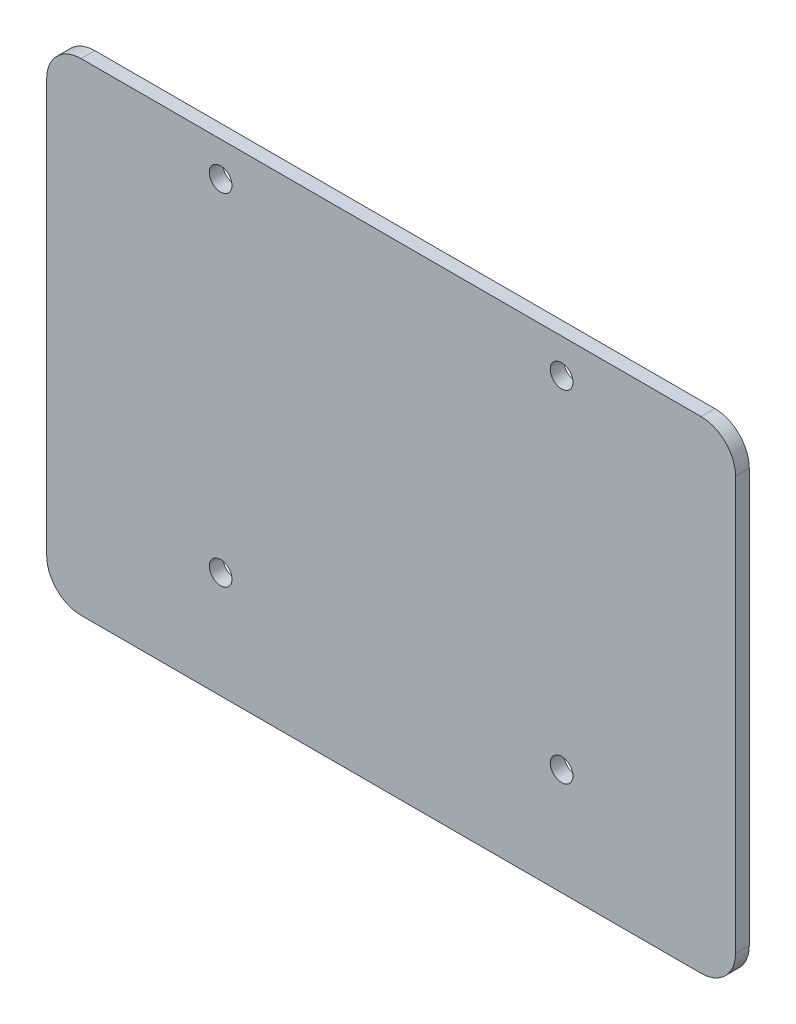
ISO-10303-21;
HEADER;
FILE_DESCRIPTION(('STEP AP214'),'2;1');
FILE_NAME('part.step','',(''),(''),'','','');
FILE_SCHEMA(('AUTOMOTIVE_DESIGN { 1 0 10303 214 1 1 1 1 }'));
ENDSEC;
DATA;
#1=APPLICATION_CONTEXT('core data for automotive mechanical design processes');
#2=APPLICATION_PROTOCOL_DEFINITION('international standard','automotive_design',2000,#1);
#3=PRODUCT_CONTEXT('',#1,'mechanical');
#4=PRODUCT('Part','Part','',(#3));
#5=PRODUCT_RELATED_PRODUCT_CATEGORY('part','',(#4));
#6=PRODUCT_DEFINITION_FORMATION('','',#4);
#7=PRODUCT_DEFINITION_CONTEXT('part definition',#1,'design');
#8=PRODUCT_DEFINITION('design','',#6,#7);
#9=PRODUCT_DEFINITION_SHAPE('','',#8);
#10=(LENGTH_UNIT() NAMED_UNIT(*) SI_UNIT(.MILLI.,.METRE.));
#11=(NAMED_UNIT(*) PLANE_ANGLE_UNIT() SI_UNIT($,.RADIAN.));
#12=(NAMED_UNIT(*) SI_UNIT($,.STERADIAN.) SOLID_ANGLE_UNIT());
#13=UNCERTAINTY_MEASURE_WITH_UNIT(LENGTH_MEASURE(1.E-05),#10,'distance_accuracy_value','');
#14=(GEOMETRIC_REPRESENTATION_CONTEXT(3) GLOBAL_UNCERTAINTY_ASSIGNED_CONTEXT((#13)) GLOBAL_UNIT_ASSIGNED_CONTEXT((#10,
#11,#12)) REPRESENTATION_CONTEXT('',''));
#15=CARTESIAN_POINT('',(0.,0.,0.));
#16=DIRECTION('',(0.,0.,1.));
#17=DIRECTION('',(1.,0.,0.));
#18=AXIS2_PLACEMENT_3D('',#15,#16,#17);
#19=CARTESIAN_POINT('',(0.,0.,2.));
#20=DIRECTION('',(0.,0.,-1.));
#21=DIRECTION('',(-1.,0.,0.));
#22=AXIS2_PLACEMENT_3D('',#19,#20,#21);
#23=PLANE('',#22);
#24=DIRECTION('',(-1.,0.,0.));
#25=VECTOR('',#24,1.);
#26=CARTESIAN_POINT('',(0.,70.,2.));
#27=LINE('',#26,#25);
#28=CARTESIAN_POINT('',(95.,70.,2.));
#29=VERTEX_POINT('',#28);
#30=CARTESIAN_POINT('',(5.,70.,2.));
#31=VERTEX_POINT('',#30);
#32=EDGE_CURVE('E136',#29,#31,#27,.T.);
#33=ORIENTED_EDGE('',*,*,#32,.T.);
#34=CARTESIAN_POINT('',(5.,65.,2.));
#35=DIRECTION('',(0.,0.,-1.));
#36=DIRECTION('',(-1.,0.,0.));
#37=AXIS2_PLACEMENT_3D('',#34,#35,#36);
#38=CIRCLE('',#37,5.);
#39=CARTESIAN_POINT('',(0.,65.,2.));
#40=VERTEX_POINT('',#39);
#41=EDGE_CURVE('E155',#31,#40,#38,.F.);
#42=ORIENTED_EDGE('',*,*,#41,.T.);
#43=DIRECTION('',(0.,-1.,0.));
#44=VECTOR('',#43,1.);
#45=CARTESIAN_POINT('',(0.,0.,2.));
#46=LINE('',#45,#44);
#47=CARTESIAN_POINT('',(0.,5.,2.));
#48=VERTEX_POINT('',#47);
#49=EDGE_CURVE('E119',#40,#48,#46,.T.);
#50=ORIENTED_EDGE('',*,*,#49,.T.);
#51=CARTESIAN_POINT('',(5.,5.,2.));
#52=DIRECTION('',(0.,0.,-1.));
#53=DIRECTION('',(-1.,0.,0.));
#54=AXIS2_PLACEMENT_3D('',#51,#52,#53);
#55=CIRCLE('',#54,5.);
#56=CARTESIAN_POINT('',(5.,0.,2.));
#57=VERTEX_POINT('',#56);
#58=EDGE_CURVE('E150',#48,#57,#55,.F.);
#59=ORIENTED_EDGE('',*,*,#58,.T.);
#60=DIRECTION('',(1.,0.,0.));
#61=VECTOR('',#60,1.);
#62=CARTESIAN_POINT('',(0.,0.,2.));
#63=LINE('',#62,#61);
#64=CARTESIAN_POINT('',(95.,0.,2.));
#65=VERTEX_POINT('',#64);
#66=EDGE_CURVE('E166',#57,#65,#63,.T.);
#67=ORIENTED_EDGE('',*,*,#66,.T.);
#68=CARTESIAN_POINT('',(95.,5.,2.));
#69=DIRECTION('',(0.,0.,-1.));
#70=DIRECTION('',(-1.,0.,0.));
#71=AXIS2_PLACEMENT_3D('',#68,#69,#70);
#72=CIRCLE('',#71,5.);
#73=CARTESIAN_POINT('',(100.,5.,2.));
#74=VERTEX_POINT('',#73);
#75=EDGE_CURVE('E55',#65,#74,#72,.F.);
#76=ORIENTED_EDGE('',*,*,#75,.T.);
#77=DIRECTION('',(0.,1.,0.));
#78=VECTOR('',#77,1.);
#79=CARTESIAN_POINT('',(100.,0.,2.));
#80=LINE('',#79,#78);
#81=CARTESIAN_POINT('',(100.,65.,2.));
#82=VERTEX_POINT('',#81);
#83=EDGE_CURVE('E174',#74,#82,#80,.T.);
#84=ORIENTED_EDGE('',*,*,#83,.T.);
#85=CARTESIAN_POINT('',(95.,65.,2.));
#86=DIRECTION('',(0.,0.,-1.));
#87=DIRECTION('',(-1.,0.,0.));
#88=AXIS2_PLACEMENT_3D('',#85,#86,#87);
#89=CIRCLE('',#88,5.);
#90=EDGE_CURVE('E153',#82,#29,#89,.F.);
#91=ORIENTED_EDGE('',*,*,#90,.T.);
#92=EDGE_LOOP('',(#33,#42,#50,#59,#67,#76,#84,#91));
#93=FACE_BOUND('',#92,.T.);
#94=CARTESIAN_POINT('',(25.25,65.,2.));
#95=DIRECTION('',(0.,0.,1.));
#96=DIRECTION('',(1.,0.,0.));
#97=AXIS2_PLACEMENT_3D('',#94,#95,#96);
#98=CIRCLE('',#97,1.65);
#99=CARTESIAN_POINT('',(26.9,65.,2.));
#100=VERTEX_POINT('',#99);
#101=EDGE_CURVE('E127',#100,#100,#98,.T.);
#102=ORIENTED_EDGE('',*,*,#101,.F.);
#103=EDGE_LOOP('',(#102));
#104=FACE_BOUND('',#103,.T.);
#105=CARTESIAN_POINT('',(25.25,15.5,2.));
#106=DIRECTION('',(0.,0.,1.));
#107=DIRECTION('',(1.,0.,0.));
#108=AXIS2_PLACEMENT_3D('',#105,#106,#107);
#109=CIRCLE('',#108,1.65);
#110=CARTESIAN_POINT('',(26.9,15.5,2.));
#111=VERTEX_POINT('',#110);
#112=EDGE_CURVE('E181',#111,#111,#109,.T.);
#113=ORIENTED_EDGE('',*,*,#112,.F.);
#114=EDGE_LOOP('',(#113));
#115=FACE_BOUND('',#114,.T.);
#116=CARTESIAN_POINT('',(74.75,15.5,2.));
#117=DIRECTION('',(0.,0.,1.));
#118=DIRECTION('',(-1.,0.,0.));
#119=AXIS2_PLACEMENT_3D('',#116,#117,#118);
#120=CIRCLE('',#119,1.65);
#121=CARTESIAN_POINT('',(73.1,15.5,2.));
#122=VERTEX_POINT('',#121);
#123=EDGE_CURVE('E186',#122,#122,#120,.T.);
#124=ORIENTED_EDGE('',*,*,#123,.F.);
#125=EDGE_LOOP('',(#124));
#126=FACE_BOUND('',#125,.T.);
#127=CARTESIAN_POINT('',(74.75,65.,2.));
#128=DIRECTION('',(0.,0.,1.));
#129=DIRECTION('',(-1.,0.,0.));
#130=AXIS2_PLACEMENT_3D('',#127,#128,#129);
#131=CIRCLE('',#130,1.65);
#132=CARTESIAN_POINT('',(73.1,65.,2.));
#133=VERTEX_POINT('',#132);
#134=EDGE_CURVE('E192',#133,#133,#131,.T.);
#135=ORIENTED_EDGE('',*,*,#134,.F.);
#136=EDGE_LOOP('',(#135));
#137=FACE_BOUND('',#136,.T.);
#138=ADVANCED_FACE('F33',(#93,#104,#115,#126,#137),#23,.F.);
#139=CARTESIAN_POINT('',(0.,0.,0.));
#140=DIRECTION('',(0.,0.,-1.));
#141=DIRECTION('',(-1.,0.,0.));
#142=AXIS2_PLACEMENT_3D('',#139,#140,#141);
#143=PLANE('',#142);
#144=CARTESIAN_POINT('',(74.75,15.5,0.));
#145=DIRECTION('',(0.,0.,1.));
#146=DIRECTION('',(-1.,0.,0.));
#147=AXIS2_PLACEMENT_3D('',#144,#145,#146);
#148=CIRCLE('',#147,1.65);
#149=CARTESIAN_POINT('',(73.1,15.5,0.));
#150=VERTEX_POINT('',#149);
#151=EDGE_CURVE('E189',#150,#150,#148,.T.);
#152=ORIENTED_EDGE('',*,*,#151,.T.);
#153=EDGE_LOOP('',(#152));
#154=FACE_BOUND('',#153,.T.);
#155=CARTESIAN_POINT('',(25.25,65.,0.));
#156=DIRECTION('',(0.,0.,1.));
#157=DIRECTION('',(1.,0.,0.));
#158=AXIS2_PLACEMENT_3D('',#155,#156,#157);
#159=CIRCLE('',#158,1.65);
#160=CARTESIAN_POINT('',(26.9,65.,0.));
#161=VERTEX_POINT('',#160);
#162=EDGE_CURVE('E133',#161,#161,#159,.T.);
#163=ORIENTED_EDGE('',*,*,#162,.T.);
#164=EDGE_LOOP('',(#163));
#165=FACE_BOUND('',#164,.T.);
#166=DIRECTION('',(0.,-1.,0.));
#167=VECTOR('',#166,1.);
#168=CARTESIAN_POINT('',(0.,0.,0.));
#169=LINE('',#168,#167);
#170=CARTESIAN_POINT('',(0.,65.,0.));
#171=VERTEX_POINT('',#170);
#172=CARTESIAN_POINT('',(0.,5.,0.));
#173=VERTEX_POINT('',#172);
#174=EDGE_CURVE('E116',#171,#173,#169,.T.);
#175=ORIENTED_EDGE('',*,*,#174,.F.);
#176=CARTESIAN_POINT('',(5.,65.,0.));
#177=DIRECTION('',(0.,0.,-1.));
#178=DIRECTION('',(-1.,0.,0.));
#179=AXIS2_PLACEMENT_3D('',#176,#177,#178);
#180=CIRCLE('',#179,5.);
#181=CARTESIAN_POINT('',(5.,70.,0.));
#182=VERTEX_POINT('',#181);
#183=EDGE_CURVE('E99',#171,#182,#180,.T.);
#184=ORIENTED_EDGE('',*,*,#183,.T.);
#185=DIRECTION('',(-1.,0.,0.));
#186=VECTOR('',#185,1.);
#187=CARTESIAN_POINT('',(0.,70.,0.));
#188=LINE('',#187,#186);
#189=CARTESIAN_POINT('',(95.,70.,0.));
#190=VERTEX_POINT('',#189);
#191=EDGE_CURVE('E140',#190,#182,#188,.T.);
#192=ORIENTED_EDGE('',*,*,#191,.F.);
#193=CARTESIAN_POINT('',(95.,65.,0.));
#194=DIRECTION('',(0.,0.,-1.));
#195=DIRECTION('',(-1.,0.,0.));
#196=AXIS2_PLACEMENT_3D('',#193,#194,#195);
#197=CIRCLE('',#196,5.);
#198=CARTESIAN_POINT('',(100.,65.,0.));
#199=VERTEX_POINT('',#198);
#200=EDGE_CURVE('E110',#190,#199,#197,.T.);
#201=ORIENTED_EDGE('',*,*,#200,.T.);
#202=DIRECTION('',(0.,1.,0.));
#203=VECTOR('',#202,1.);
#204=CARTESIAN_POINT('',(100.,0.,0.));
#205=LINE('',#204,#203);
#206=CARTESIAN_POINT('',(100.,5.,0.));
#207=VERTEX_POINT('',#206);
#208=EDGE_CURVE('E130',#207,#199,#205,.T.);
#209=ORIENTED_EDGE('',*,*,#208,.F.);
#210=CARTESIAN_POINT('',(95.,5.,0.));
#211=DIRECTION('',(0.,0.,-1.));
#212=DIRECTION('',(-1.,0.,0.));
#213=AXIS2_PLACEMENT_3D('',#210,#211,#212);
#214=CIRCLE('',#213,5.);
#215=CARTESIAN_POINT('',(95.,0.,0.));
#216=VERTEX_POINT('',#215);
#217=EDGE_CURVE('E144',#207,#216,#214,.T.);
#218=ORIENTED_EDGE('',*,*,#217,.T.);
#219=DIRECTION('',(1.,0.,0.));
#220=VECTOR('',#219,1.);
#221=CARTESIAN_POINT('',(0.,0.,0.));
#222=LINE('',#221,#220);
#223=CARTESIAN_POINT('',(5.,0.,0.));
#224=VERTEX_POINT('',#223);
#225=EDGE_CURVE('E126',#224,#216,#222,.T.);
#226=ORIENTED_EDGE('',*,*,#225,.F.);
#227=CARTESIAN_POINT('',(5.,5.,0.));
#228=DIRECTION('',(0.,0.,-1.));
#229=DIRECTION('',(-1.,0.,0.));
#230=AXIS2_PLACEMENT_3D('',#227,#228,#229);
#231=CIRCLE('',#230,5.);
#232=EDGE_CURVE('E120',#224,#173,#231,.T.);
#233=ORIENTED_EDGE('',*,*,#232,.T.);
#234=EDGE_LOOP('',(#175,#184,#192,#201,#209,#218,#226,#233));
#235=FACE_BOUND('',#234,.T.);
#236=CARTESIAN_POINT('',(25.25,15.5,0.));
#237=DIRECTION('',(0.,0.,1.));
#238=DIRECTION('',(1.,0.,0.));
#239=AXIS2_PLACEMENT_3D('',#236,#237,#238);
#240=CIRCLE('',#239,1.65);
#241=CARTESIAN_POINT('',(26.9,15.5,0.));
#242=VERTEX_POINT('',#241);
#243=EDGE_CURVE('E183',#242,#242,#240,.T.);
#244=ORIENTED_EDGE('',*,*,#243,.T.);
#245=EDGE_LOOP('',(#244));
#246=FACE_BOUND('',#245,.T.);
#247=CARTESIAN_POINT('',(74.75,65.,0.));
#248=DIRECTION('',(0.,0.,1.));
#249=DIRECTION('',(-1.,0.,0.));
#250=AXIS2_PLACEMENT_3D('',#247,#248,#249);
#251=CIRCLE('',#250,1.65);
#252=CARTESIAN_POINT('',(73.1,65.,0.));
#253=VERTEX_POINT('',#252);
#254=EDGE_CURVE('E195',#253,#253,#251,.T.);
#255=ORIENTED_EDGE('',*,*,#254,.T.);
#256=EDGE_LOOP('',(#255));
#257=FACE_BOUND('',#256,.T.);
#258=ADVANCED_FACE('F123',(#154,#165,#235,#246,#257),#143,.T.);
#259=CARTESIAN_POINT('',(0.,0.,2.));
#260=DIRECTION('',(1.,0.,0.));
#261=DIRECTION('',(0.,0.,-1.));
#262=AXIS2_PLACEMENT_3D('',#259,#260,#261);
#263=PLANE('',#262);
#264=ORIENTED_EDGE('',*,*,#49,.F.);
#265=DIRECTION('',(0.,0.,-1.));
#266=VECTOR('',#265,1.);
#267=CARTESIAN_POINT('',(0.,65.,2.));
#268=LINE('',#267,#266);
#269=EDGE_CURVE('E103',#40,#171,#268,.T.);
#270=ORIENTED_EDGE('',*,*,#269,.T.);
#271=ORIENTED_EDGE('',*,*,#174,.T.);
#272=DIRECTION('',(0.,0.,-1.));
#273=VECTOR('',#272,1.);
#274=CARTESIAN_POINT('',(0.,5.,2.));
#275=LINE('',#274,#273);
#276=EDGE_CURVE('E121',#173,#48,#275,.F.);
#277=ORIENTED_EDGE('',*,*,#276,.T.);
#278=EDGE_LOOP('',(#264,#270,#271,#277));
#279=FACE_BOUND('',#278,.T.);
#280=ADVANCED_FACE('F115',(#279),#263,.F.);
#281=CARTESIAN_POINT('',(0.,0.,2.));
#282=DIRECTION('',(0.,1.,0.));
#283=DIRECTION('',(0.,0.,1.));
#284=AXIS2_PLACEMENT_3D('',#281,#282,#283);
#285=PLANE('',#284);
#286=ORIENTED_EDGE('',*,*,#225,.T.);
#287=DIRECTION('',(0.,0.,-1.));
#288=VECTOR('',#287,1.);
#289=CARTESIAN_POINT('',(95.,0.,2.));
#290=LINE('',#289,#288);
#291=EDGE_CURVE('E11',#216,#65,#290,.F.);
#292=ORIENTED_EDGE('',*,*,#291,.T.);
#293=ORIENTED_EDGE('',*,*,#66,.F.);
#294=DIRECTION('',(0.,0.,-1.));
#295=VECTOR('',#294,1.);
#296=CARTESIAN_POINT('',(5.,0.,2.));
#297=LINE('',#296,#295);
#298=EDGE_CURVE('E41',#57,#224,#297,.T.);
#299=ORIENTED_EDGE('',*,*,#298,.T.);
#300=EDGE_LOOP('',(#286,#292,#293,#299));
#301=FACE_BOUND('',#300,.T.);
#302=ADVANCED_FACE('F164',(#301),#285,.F.);
#303=CARTESIAN_POINT('',(100.,0.,2.));
#304=DIRECTION('',(-1.,0.,0.));
#305=DIRECTION('',(0.,0.,1.));
#306=AXIS2_PLACEMENT_3D('',#303,#304,#305);
#307=PLANE('',#306);
#308=ORIENTED_EDGE('',*,*,#208,.T.);
#309=DIRECTION('',(0.,0.,-1.));
#310=VECTOR('',#309,1.);
#311=CARTESIAN_POINT('',(100.,65.,2.));
#312=LINE('',#311,#310);
#313=EDGE_CURVE('E48',#199,#82,#312,.F.);
#314=ORIENTED_EDGE('',*,*,#313,.T.);
#315=ORIENTED_EDGE('',*,*,#83,.F.);
#316=DIRECTION('',(0.,0.,-1.));
#317=VECTOR('',#316,1.);
#318=CARTESIAN_POINT('',(100.,5.,2.));
#319=LINE('',#318,#317);
#320=EDGE_CURVE('E157',#74,#207,#319,.T.);
#321=ORIENTED_EDGE('',*,*,#320,.T.);
#322=EDGE_LOOP('',(#308,#314,#315,#321));
#323=FACE_BOUND('',#322,.T.);
#324=ADVANCED_FACE('F173',(#323),#307,.F.);
#325=CARTESIAN_POINT('',(0.,70.,2.));
#326=DIRECTION('',(0.,-1.,0.));
#327=DIRECTION('',(0.,0.,-1.));
#328=AXIS2_PLACEMENT_3D('',#325,#326,#327);
#329=PLANE('',#328);
#330=ORIENTED_EDGE('',*,*,#191,.T.);
#331=DIRECTION('',(0.,0.,-1.));
#332=VECTOR('',#331,1.);
#333=CARTESIAN_POINT('',(5.,70.,2.));
#334=LINE('',#333,#332);
#335=EDGE_CURVE('E104',#182,#31,#334,.F.);
#336=ORIENTED_EDGE('',*,*,#335,.T.);
#337=ORIENTED_EDGE('',*,*,#32,.F.);
#338=DIRECTION('',(0.,0.,-1.));
#339=VECTOR('',#338,1.);
#340=CARTESIAN_POINT('',(95.,70.,2.));
#341=LINE('',#340,#339);
#342=EDGE_CURVE('E109',#29,#190,#341,.T.);
#343=ORIENTED_EDGE('',*,*,#342,.T.);
#344=EDGE_LOOP('',(#330,#336,#337,#343));
#345=FACE_BOUND('',#344,.T.);
#346=ADVANCED_FACE('F216',(#345),#329,.F.);
#347=CARTESIAN_POINT('',(25.25,65.,2.));
#348=DIRECTION('',(0.,0.,-1.));
#349=DIRECTION('',(-1.,0.,0.));
#350=AXIS2_PLACEMENT_3D('',#347,#348,#349);
#351=CYLINDRICAL_SURFACE('',#350,1.65);
#352=ORIENTED_EDGE('',*,*,#101,.T.);
#353=EDGE_LOOP('',(#352));
#354=FACE_BOUND('',#353,.T.);
#355=ORIENTED_EDGE('',*,*,#162,.F.);
#356=EDGE_LOOP('',(#355));
#357=FACE_BOUND('',#356,.T.);
#358=ADVANCED_FACE('F213',(#354,#357),#351,.F.);
#359=CARTESIAN_POINT('',(25.25,15.5,2.));
#360=DIRECTION('',(0.,0.,-1.));
#361=DIRECTION('',(-1.,0.,0.));
#362=AXIS2_PLACEMENT_3D('',#359,#360,#361);
#363=CYLINDRICAL_SURFACE('',#362,1.65);
#364=ORIENTED_EDGE('',*,*,#112,.T.);
#365=EDGE_LOOP('',(#364));
#366=FACE_BOUND('',#365,.T.);
#367=ORIENTED_EDGE('',*,*,#243,.F.);
#368=EDGE_LOOP('',(#367));
#369=FACE_BOUND('',#368,.T.);
#370=ADVANCED_FACE('F309',(#366,#369),#363,.F.);
#371=CARTESIAN_POINT('',(74.75,15.5,2.));
#372=DIRECTION('',(0.,0.,-1.));
#373=DIRECTION('',(-1.,0.,0.));
#374=AXIS2_PLACEMENT_3D('',#371,#372,#373);
#375=CYLINDRICAL_SURFACE('',#374,1.65);
#376=ORIENTED_EDGE('',*,*,#123,.T.);
#377=EDGE_LOOP('',(#376));
#378=FACE_BOUND('',#377,.T.);
#379=ORIENTED_EDGE('',*,*,#151,.F.);
#380=EDGE_LOOP('',(#379));
#381=FACE_BOUND('',#380,.T.);
#382=ADVANCED_FACE('F300',(#378,#381),#375,.F.);
#383=CARTESIAN_POINT('',(74.75,65.,2.));
#384=DIRECTION('',(0.,0.,-1.));
#385=DIRECTION('',(-1.,0.,0.));
#386=AXIS2_PLACEMENT_3D('',#383,#384,#385);
#387=CYLINDRICAL_SURFACE('',#386,1.65);
#388=ORIENTED_EDGE('',*,*,#134,.T.);
#389=EDGE_LOOP('',(#388));
#390=FACE_BOUND('',#389,.T.);
#391=ORIENTED_EDGE('',*,*,#254,.F.);
#392=EDGE_LOOP('',(#391));
#393=FACE_BOUND('',#392,.T.);
#394=ADVANCED_FACE('F201',(#390,#393),#387,.F.);
#395=CARTESIAN_POINT('',(5.,65.,2.));
#396=DIRECTION('',(0.,0.,-1.));
#397=DIRECTION('',(-1.,0.,0.));
#398=AXIS2_PLACEMENT_3D('',#395,#396,#397);
#399=CYLINDRICAL_SURFACE('',#398,5.);
#400=ORIENTED_EDGE('',*,*,#41,.F.);
#401=ORIENTED_EDGE('',*,*,#335,.F.);
#402=ORIENTED_EDGE('',*,*,#183,.F.);
#403=ORIENTED_EDGE('',*,*,#269,.F.);
#404=EDGE_LOOP('',(#400,#401,#402,#403));
#405=FACE_BOUND('',#404,.T.);
#406=ADVANCED_FACE('F102',(#405),#399,.T.);
#407=CARTESIAN_POINT('',(95.,65.,2.));
#408=DIRECTION('',(0.,0.,-1.));
#409=DIRECTION('',(-1.,0.,0.));
#410=AXIS2_PLACEMENT_3D('',#407,#408,#409);
#411=CYLINDRICAL_SURFACE('',#410,5.);
#412=ORIENTED_EDGE('',*,*,#90,.F.);
#413=ORIENTED_EDGE('',*,*,#313,.F.);
#414=ORIENTED_EDGE('',*,*,#200,.F.);
#415=ORIENTED_EDGE('',*,*,#342,.F.);
#416=EDGE_LOOP('',(#412,#413,#414,#415));
#417=FACE_BOUND('',#416,.T.);
#418=ADVANCED_FACE('F228',(#417),#411,.T.);
#419=CARTESIAN_POINT('',(95.,5.,2.));
#420=DIRECTION('',(0.,0.,-1.));
#421=DIRECTION('',(-1.,0.,0.));
#422=AXIS2_PLACEMENT_3D('',#419,#420,#421);
#423=CYLINDRICAL_SURFACE('',#422,5.);
#424=ORIENTED_EDGE('',*,*,#75,.F.);
#425=ORIENTED_EDGE('',*,*,#291,.F.);
#426=ORIENTED_EDGE('',*,*,#217,.F.);
#427=ORIENTED_EDGE('',*,*,#320,.F.);
#428=EDGE_LOOP('',(#424,#425,#426,#427));
#429=FACE_BOUND('',#428,.T.);
#430=ADVANCED_FACE('F172',(#429),#423,.T.);
#431=CARTESIAN_POINT('',(5.,5.,2.));
#432=DIRECTION('',(0.,0.,-1.));
#433=DIRECTION('',(-1.,0.,0.));
#434=AXIS2_PLACEMENT_3D('',#431,#432,#433);
#435=CYLINDRICAL_SURFACE('',#434,5.);
#436=ORIENTED_EDGE('',*,*,#58,.F.);
#437=ORIENTED_EDGE('',*,*,#276,.F.);
#438=ORIENTED_EDGE('',*,*,#232,.F.);
#439=ORIENTED_EDGE('',*,*,#298,.F.);
#440=EDGE_LOOP('',(#436,#437,#438,#439));
#441=FACE_BOUND('',#440,.T.);
#442=ADVANCED_FACE('F35',(#441),#435,.T.);
#443=CLOSED_SHELL('',(#138,#258,#280,#302,#324,#346,#358,#370,#382,#394,#406,#418,#430,#442));
#444=MANIFOLD_SOLID_BREP('B2',#443);
#445=ADVANCED_BREP_SHAPE_REPRESENTATION('',(#18,#444),#14);
#446=SHAPE_DEFINITION_REPRESENTATION(#9,#445);
ENDSEC;
END-ISO-10303-21;
